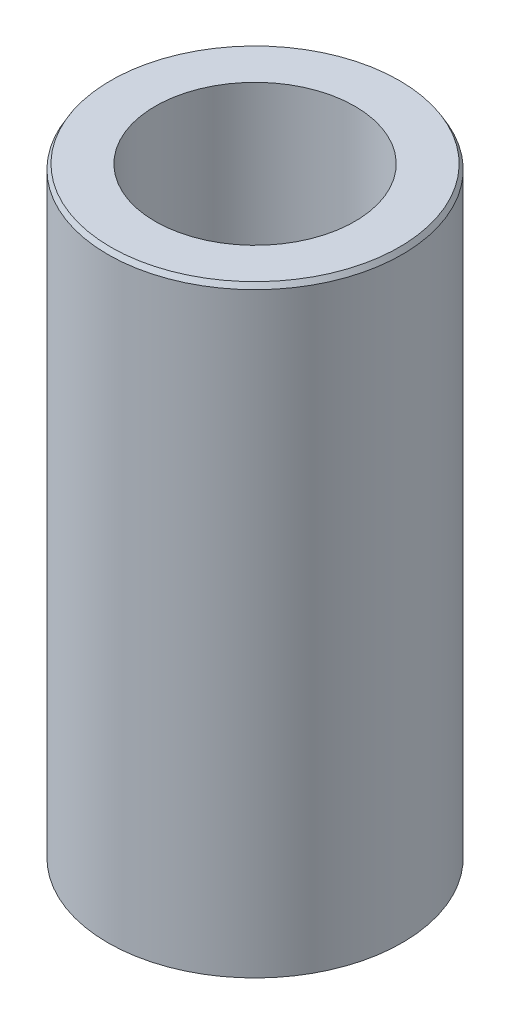
ISO-10303-21;
HEADER;
FILE_DESCRIPTION(('STEP AP214'),'2;1');
FILE_NAME('part.step','',(''),(''),'','','');
FILE_SCHEMA(('AUTOMOTIVE_DESIGN { 1 0 10303 214 1 1 1 1 }'));
ENDSEC;
DATA;
#1=APPLICATION_CONTEXT('core data for automotive mechanical design processes');
#2=APPLICATION_PROTOCOL_DEFINITION('international standard','automotive_design',2000,#1);
#3=PRODUCT_CONTEXT('',#1,'mechanical');
#4=PRODUCT('Part','Part','',(#3));
#5=PRODUCT_RELATED_PRODUCT_CATEGORY('part','',(#4));
#6=PRODUCT_DEFINITION_FORMATION('','',#4);
#7=PRODUCT_DEFINITION_CONTEXT('part definition',#1,'design');
#8=PRODUCT_DEFINITION('design','',#6,#7);
#9=PRODUCT_DEFINITION_SHAPE('','',#8);
#10=(LENGTH_UNIT() NAMED_UNIT(*) SI_UNIT(.MILLI.,.METRE.));
#11=(NAMED_UNIT(*) PLANE_ANGLE_UNIT() SI_UNIT($,.RADIAN.));
#12=(NAMED_UNIT(*) SI_UNIT($,.STERADIAN.) SOLID_ANGLE_UNIT());
#13=UNCERTAINTY_MEASURE_WITH_UNIT(LENGTH_MEASURE(1.E-05),#10,'distance_accuracy_value','');
#14=(GEOMETRIC_REPRESENTATION_CONTEXT(3) GLOBAL_UNCERTAINTY_ASSIGNED_CONTEXT((#13)) GLOBAL_UNIT_ASSIGNED_CONTEXT((#10,
#11,#12)) REPRESENTATION_CONTEXT('',''));
#15=CARTESIAN_POINT('',(0.,0.,0.));
#16=DIRECTION('',(0.,0.,1.));
#17=DIRECTION('',(1.,0.,0.));
#18=AXIS2_PLACEMENT_3D('',#15,#16,#17);
#19=CARTESIAN_POINT('',(0.,143.59537178825,0.));
#20=DIRECTION('',(0.,-1.,0.));
#21=DIRECTION('',(0.,0.,-1.));
#22=AXIS2_PLACEMENT_3D('',#19,#20,#21);
#23=CYLINDRICAL_SURFACE('',#22,35.);
#24=CARTESIAN_POINT('',(0.,142.418659375602,0.));
#25=DIRECTION('',(0.,1.,0.));
#26=DIRECTION('',(0.,0.,1.));
#27=AXIS2_PLACEMENT_3D('',#24,#25,#26);
#28=CIRCLE('',#27,35.);
#29=CARTESIAN_POINT('',(0.,142.418659375602,35.));
#30=VERTEX_POINT('',#29);
#31=EDGE_CURVE('E50',#30,#30,#28,.F.);
#32=ORIENTED_EDGE('',*,*,#31,.T.);
#33=EDGE_LOOP('',(#32));
#34=FACE_BOUND('',#33,.T.);
#35=CARTESIAN_POINT('',(0.,0.679375228201273,0.));
#36=DIRECTION('',(0.,1.,0.));
#37=DIRECTION('',(0.,0.,1.));
#38=AXIS2_PLACEMENT_3D('',#35,#36,#37);
#39=CIRCLE('',#38,35.);
#40=CARTESIAN_POINT('',(0.,0.679375228201273,35.));
#41=VERTEX_POINT('',#40);
#42=EDGE_CURVE('E51',#41,#41,#39,.T.);
#43=ORIENTED_EDGE('',*,*,#42,.T.);
#44=EDGE_LOOP('',(#43));
#45=FACE_BOUND('',#44,.T.);
#46=ADVANCED_FACE('F39',(#34,#45),#23,.T.);
#47=CARTESIAN_POINT('',(0.,143.59537178825,0.));
#48=DIRECTION('',(0.,1.,0.));
#49=DIRECTION('',(0.,0.,1.));
#50=AXIS2_PLACEMENT_3D('',#47,#48,#49);
#51=PLANE('',#50);
#52=CARTESIAN_POINT('',(0.,143.59537178825,0.));
#53=DIRECTION('',(0.,1.,0.));
#54=DIRECTION('',(0.,0.,1.));
#55=AXIS2_PLACEMENT_3D('',#52,#53,#54);
#56=CIRCLE('',#55,34.3206247717987);
#57=CARTESIAN_POINT('',(0.,143.59537178825,34.3206247717987));
#58=VERTEX_POINT('',#57);
#59=EDGE_CURVE('E54',#58,#58,#56,.T.);
#60=ORIENTED_EDGE('',*,*,#59,.T.);
#61=EDGE_LOOP('',(#60));
#62=FACE_BOUND('',#61,.T.);
#63=CARTESIAN_POINT('',(0.,143.59537178825,0.));
#64=DIRECTION('',(0.,1.,0.));
#65=DIRECTION('',(0.,0.,1.));
#66=AXIS2_PLACEMENT_3D('',#63,#64,#65);
#67=CIRCLE('',#66,23.7403781227796);
#68=CARTESIAN_POINT('',(0.,143.59537178825,23.7403781227796));
#69=VERTEX_POINT('',#68);
#70=EDGE_CURVE('E58',#69,#69,#67,.T.);
#71=ORIENTED_EDGE('',*,*,#70,.F.);
#72=EDGE_LOOP('',(#71));
#73=FACE_BOUND('',#72,.T.);
#74=ADVANCED_FACE('F69',(#62,#73),#51,.T.);
#75=CARTESIAN_POINT('',(0.,0.,0.));
#76=DIRECTION('',(0.,1.,0.));
#77=DIRECTION('',(0.,0.,1.));
#78=AXIS2_PLACEMENT_3D('',#75,#76,#77);
#79=PLANE('',#78);
#80=CARTESIAN_POINT('',(0.,0.,0.));
#81=DIRECTION('',(0.,1.,0.));
#82=DIRECTION('',(0.,0.,1.));
#83=AXIS2_PLACEMENT_3D('',#80,#81,#82);
#84=CIRCLE('',#83,33.8232875873517);
#85=CARTESIAN_POINT('',(0.,0.,33.8232875873517));
#86=VERTEX_POINT('',#85);
#87=EDGE_CURVE('E10',#86,#86,#84,.F.);
#88=ORIENTED_EDGE('',*,*,#87,.T.);
#89=EDGE_LOOP('',(#88));
#90=FACE_BOUND('',#89,.T.);
#91=CARTESIAN_POINT('',(0.,0.,0.));
#92=DIRECTION('',(0.,1.,0.));
#93=DIRECTION('',(0.,0.,1.));
#94=AXIS2_PLACEMENT_3D('',#91,#92,#93);
#95=CIRCLE('',#94,23.7403781227796);
#96=CARTESIAN_POINT('',(0.,0.,23.7403781227796));
#97=VERTEX_POINT('',#96);
#98=EDGE_CURVE('E63',#97,#97,#95,.T.);
#99=ORIENTED_EDGE('',*,*,#98,.T.);
#100=EDGE_LOOP('',(#99));
#101=FACE_BOUND('',#100,.T.);
#102=ADVANCED_FACE('F75',(#90,#101),#79,.F.);
#103=CARTESIAN_POINT('',(0.,143.59537178825,0.));
#104=DIRECTION('',(0.,-1.,0.));
#105=DIRECTION('',(0.,0.,-1.));
#106=AXIS2_PLACEMENT_3D('',#103,#104,#105);
#107=CYLINDRICAL_SURFACE('',#106,23.7403781227796);
#108=ORIENTED_EDGE('',*,*,#70,.T.);
#109=EDGE_LOOP('',(#108));
#110=FACE_BOUND('',#109,.T.);
#111=ORIENTED_EDGE('',*,*,#98,.F.);
#112=EDGE_LOOP('',(#111));
#113=FACE_BOUND('',#112,.T.);
#114=ADVANCED_FACE('F70',(#110,#113),#107,.F.);
#115=CARTESIAN_POINT('',(0.,143.59537178825,0.));
#116=DIRECTION('',(0.,-1.,0.));
#117=DIRECTION('',(0.,0.,-1.));
#118=AXIS2_PLACEMENT_3D('',#115,#116,#117);
#119=CONICAL_SURFACE('',#118,34.3206247717987,0.523598775598302);
#120=ORIENTED_EDGE('',*,*,#31,.F.);
#121=EDGE_LOOP('',(#120));
#122=FACE_BOUND('',#121,.T.);
#123=ORIENTED_EDGE('',*,*,#59,.F.);
#124=EDGE_LOOP('',(#123));
#125=FACE_BOUND('',#124,.T.);
#126=ADVANCED_FACE('F81',(#122,#125),#119,.T.);
#127=CARTESIAN_POINT('',(0.,0.679375228201273,0.));
#128=DIRECTION('',(0.,1.,0.));
#129=DIRECTION('',(0.,0.,1.));
#130=AXIS2_PLACEMENT_3D('',#127,#128,#129);
#131=CONICAL_SURFACE('',#130,35.,1.04719755119661);
#132=CARTESIAN_POINT('',(0.,0.,33.8232875873517));
#133=CARTESIAN_POINT('',(0.,0.00707682529376465,33.8355450083168));
#134=CARTESIAN_POINT('',(0.,0.0141536505875274,33.8478024292818));
#135=CARTESIAN_POINT('',(0.,0.028307301175053,33.872317271212));
#136=CARTESIAN_POINT('',(0.,0.0353841264688157,33.8845746921771));
#137=CARTESIAN_POINT('',(0.,0.0495377770563422,33.9090895341073));
#138=CARTESIAN_POINT('',(0.,0.0566146023501059,33.9213469550724));
#139=CARTESIAN_POINT('',(0.,0.0707682529376326,33.9458617970025));
#140=CARTESIAN_POINT('',(0.,0.0778450782313957,33.9581192179676));
#141=CARTESIAN_POINT('',(0.,0.0919987288189224,33.9826340598978));
#142=CARTESIAN_POINT('',(0.,0.0990755541126862,33.9948914808629));
#143=CARTESIAN_POINT('',(0.,0.113229204700212,34.0194063227931));
#144=CARTESIAN_POINT('',(0.,0.120306029993975,34.0316637437582));
#145=CARTESIAN_POINT('',(0.,0.134459680581501,34.0561785856883));
#146=CARTESIAN_POINT('',(0.,0.141536505875265,34.0684360066534));
#147=CARTESIAN_POINT('',(0.,0.155690156462792,34.0929508485836));
#148=CARTESIAN_POINT('',(0.,0.162766981756555,34.1052082695487));
#149=CARTESIAN_POINT('',(0.,0.176920632344082,34.1297231114788));
#150=CARTESIAN_POINT('',(0.,0.183997457637845,34.1419805324439));
#151=CARTESIAN_POINT('',(0.,0.198151108225372,34.1664953743741));
#152=CARTESIAN_POINT('',(0.,0.205227933519134,34.1787527953392));
#153=CARTESIAN_POINT('',(0.,0.21938158410666,34.2032676372694));
#154=CARTESIAN_POINT('',(0.,0.226458409400424,34.2155250582345));
#155=CARTESIAN_POINT('',(0.,0.240612059987951,34.2400399001646));
#156=CARTESIAN_POINT('',(0.,0.247688885281715,34.2522973211297));
#157=CARTESIAN_POINT('',(0.,0.261842535869241,34.2768121630599));
#158=CARTESIAN_POINT('',(0.,0.268919361163004,34.289069584025));
#159=CARTESIAN_POINT('',(0.,0.28307301175053,34.3135844259551));
#160=CARTESIAN_POINT('',(0.,0.290149837044294,34.3258418469202));
#161=CARTESIAN_POINT('',(0.,0.30430348763182,34.3503566888504));
#162=CARTESIAN_POINT('',(0.,0.311380312925583,34.3626141098155));
#163=CARTESIAN_POINT('',(0.,0.32553396351311,34.3871289517457));
#164=CARTESIAN_POINT('',(0.,0.332610788806874,34.3993863727108));
#165=CARTESIAN_POINT('',(0.,0.3467644393944,34.4239012146409));
#166=CARTESIAN_POINT('',(0.,0.353841264688163,34.436158635606));
#167=CARTESIAN_POINT('',(0.,0.367994915275689,34.4606734775362));
#168=CARTESIAN_POINT('',(0.,0.375071740569453,34.4729308985013));
#169=CARTESIAN_POINT('',(0.,0.38922539115698,34.4974457404314));
#170=CARTESIAN_POINT('',(0.,0.396302216450743,34.5097031613965));
#171=CARTESIAN_POINT('',(0.,0.41045586703827,34.5342180033267));
#172=CARTESIAN_POINT('',(0.,0.417532692332032,34.5464754242918));
#173=CARTESIAN_POINT('',(0.,0.431686342919558,34.570990266222));
#174=CARTESIAN_POINT('',(0.,0.438763168213322,34.5832476871871));
#175=CARTESIAN_POINT('',(0.,0.452916818800849,34.6077625291172));
#176=CARTESIAN_POINT('',(0.,0.459993644094612,34.6200199500823));
#177=CARTESIAN_POINT('',(0.,0.474147294682139,34.6445347920125));
#178=CARTESIAN_POINT('',(0.,0.481224119975902,34.6567922129776));
#179=CARTESIAN_POINT('',(0.,0.495377770563429,34.6813070549078));
#180=CARTESIAN_POINT('',(0.,0.502454595857191,34.6935644758728));
#181=CARTESIAN_POINT('',(0.,0.516608246444718,34.718079317803));
#182=CARTESIAN_POINT('',(0.,0.523685071738481,34.7303367387681));
#183=CARTESIAN_POINT('',(0.,0.537838722326008,34.7548515806983));
#184=CARTESIAN_POINT('',(0.,0.544915547619772,34.7671090016634));
#185=CARTESIAN_POINT('',(0.,0.559069198207298,34.7916238435935));
#186=CARTESIAN_POINT('',(0.,0.566146023501061,34.8038812645586));
#187=CARTESIAN_POINT('',(0.,0.580299674088587,34.8283961064888));
#188=CARTESIAN_POINT('',(0.,0.587376499382351,34.8406535274539));
#189=CARTESIAN_POINT('',(0.,0.601530149969878,34.8651683693841));
#190=CARTESIAN_POINT('',(0.,0.60860697526364,34.8774257903491));
#191=CARTESIAN_POINT('',(0.,0.622760625851167,34.9019406322793));
#192=CARTESIAN_POINT('',(0.,0.629837451144931,34.9141980532444));
#193=CARTESIAN_POINT('',(0.,0.643991101732457,34.9387128951746));
#194=CARTESIAN_POINT('',(0.,0.65106792702622,34.9509703161397));
#195=CARTESIAN_POINT('',(0.,0.665221577613746,34.9754851580698));
#196=CARTESIAN_POINT('',(0.,0.672298402907509,34.9877425790349));
#197=CARTESIAN_POINT('',(0.,0.679375228201273,35.));
#198=B_SPLINE_CURVE_WITH_KNOTS('',3,(#132,#133,#134,#135,#136,#137,#138,#139,#140,#141,#142,
#143,#144,#145,#146,#147,#148,#149,#150,#151,#152,#153,#154,#155,#156,#157,#158,#159,#160,#161,
#162,#163,#164,#165,#166,#167,#168,#169,#170,#171,#172,#173,#174,#175,#176,#177,#178,#179,#180,
#181,#182,#183,#184,#185,#186,#187,#188,#189,#190,#191,#192,#193,#194,#195,#196,#197),
.UNSPECIFIED.,.F.,.F.,(4,2,2,2,2,2,2,2,2,2,2,2,2,2,2,2,2,2,2,2,2,2,2,2,2,2,2,2,2,2,2,2,4),(0.,
0.0424609517625787,0.0849219035251634,0.127382855287742,0.169843807050321,0.2123047588129,
0.254765710575484,0.297226662338063,0.339687614100642,0.38214856586322,0.424609517625805,
0.467070469388384,0.509531421150963,0.551992372913547,0.594453324676126,0.636914276438705,
0.679375228201283,0.721836179963868,0.764297131726447,0.806758083489025,0.84921903525161,
0.891679987014189,0.934140938776768,0.976601890539346,1.01906284230193,1.06152379406451,
1.10398474582709,1.14644569758967,1.18890664935225,1.23136760111483,1.27382855287741,
1.31628950463999,1.35875045640257),.UNSPECIFIED.);
#199=EDGE_CURVE('BSEAM45',#86,#41,#198,.T.);
#200=ORIENTED_EDGE('',*,*,#87,.F.);
#201=ORIENTED_EDGE('',*,*,#42,.F.);
#202=ORIENTED_EDGE('',*,*,#199,.T.);
#203=ORIENTED_EDGE('',*,*,#199,.F.);
#204=EDGE_LOOP('',(#200,#202,#201,#203));
#205=FACE_BOUND('',#204,.T.);
#206=ADVANCED_FACE('F45',(#205),#131,.T.);
#207=CLOSED_SHELL('',(#46,#74,#102,#114,#126,#206));
#208=MANIFOLD_SOLID_BREP('B2',#207);
#209=ADVANCED_BREP_SHAPE_REPRESENTATION('',(#18,#208),#14);
#210=SHAPE_DEFINITION_REPRESENTATION(#9,#209);
ENDSEC;
END-ISO-10303-21;
